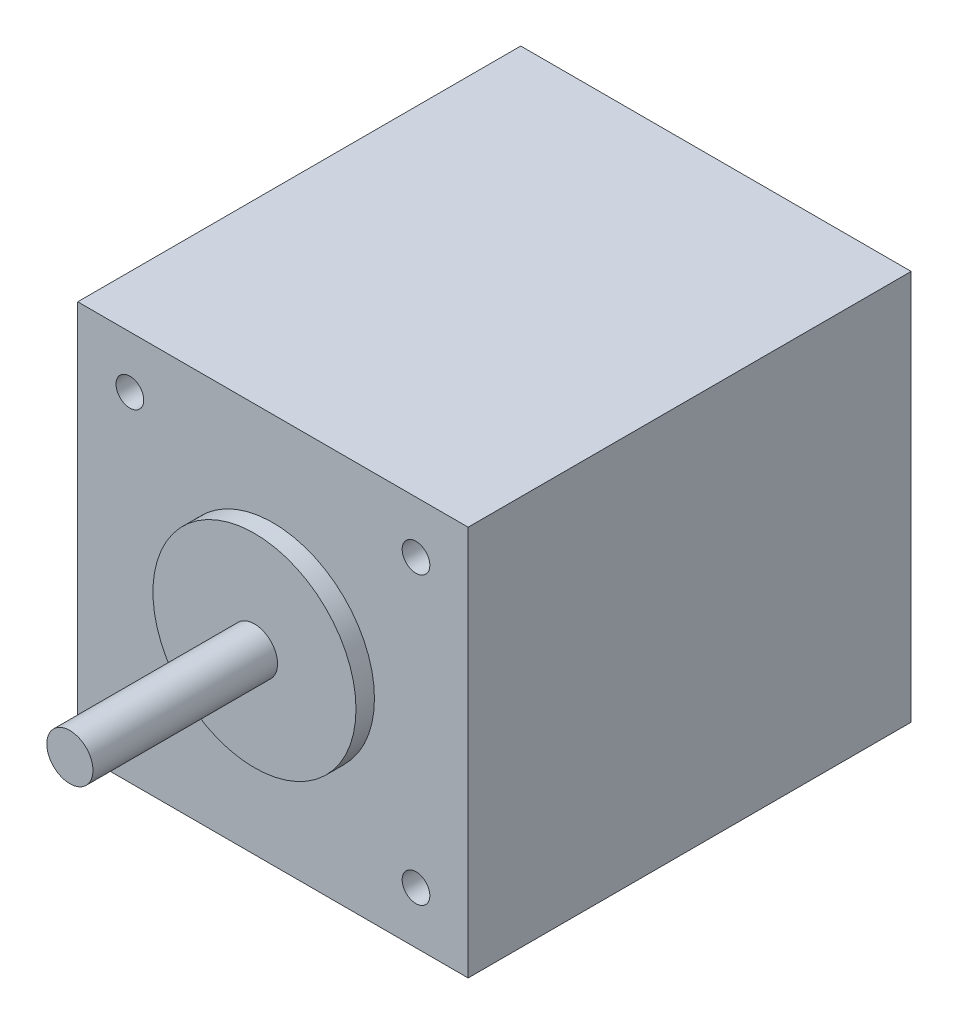
ISO-10303-21;
HEADER;
FILE_DESCRIPTION(('STEP AP214'),'2;1');
FILE_NAME('part.step','',(''),(''),'','','');
FILE_SCHEMA(('AUTOMOTIVE_DESIGN { 1 0 10303 214 1 1 1 1 }'));
ENDSEC;
DATA;
#1=APPLICATION_CONTEXT('core data for automotive mechanical design processes');
#2=APPLICATION_PROTOCOL_DEFINITION('international standard','automotive_design',2000,#1);
#3=PRODUCT_CONTEXT('',#1,'mechanical');
#4=PRODUCT('Part','Part','',(#3));
#5=PRODUCT_RELATED_PRODUCT_CATEGORY('part','',(#4));
#6=PRODUCT_DEFINITION_FORMATION('','',#4);
#7=PRODUCT_DEFINITION_CONTEXT('part definition',#1,'design');
#8=PRODUCT_DEFINITION('design','',#6,#7);
#9=PRODUCT_DEFINITION_SHAPE('','',#8);
#10=(LENGTH_UNIT() NAMED_UNIT(*) SI_UNIT(.MILLI.,.METRE.));
#11=(NAMED_UNIT(*) PLANE_ANGLE_UNIT() SI_UNIT($,.RADIAN.));
#12=(NAMED_UNIT(*) SI_UNIT($,.STERADIAN.) SOLID_ANGLE_UNIT());
#13=UNCERTAINTY_MEASURE_WITH_UNIT(LENGTH_MEASURE(1.E-05),#10,'distance_accuracy_value','');
#14=(GEOMETRIC_REPRESENTATION_CONTEXT(3) GLOBAL_UNCERTAINTY_ASSIGNED_CONTEXT((#13)) GLOBAL_UNIT_ASSIGNED_CONTEXT((#10,
#11,#12)) REPRESENTATION_CONTEXT('',''));
#15=CARTESIAN_POINT('',(0.,0.,0.));
#16=DIRECTION('',(0.,0.,1.));
#17=DIRECTION('',(1.,0.,0.));
#18=AXIS2_PLACEMENT_3D('',#15,#16,#17);
#19=CARTESIAN_POINT('',(-21.15,-21.15,0.));
#20=DIRECTION('',(0.,-1.,0.));
#21=DIRECTION('',(0.,0.,-1.));
#22=AXIS2_PLACEMENT_3D('',#19,#20,#21);
#23=PLANE('',#22);
#24=DIRECTION('',(0.,0.,-1.));
#25=VECTOR('',#24,1.);
#26=CARTESIAN_POINT('',(21.15,-21.15,0.));
#27=LINE('',#26,#25);
#28=CARTESIAN_POINT('',(21.15,-21.15,0.));
#29=VERTEX_POINT('',#28);
#30=CARTESIAN_POINT('',(21.15,-21.15,-48.));
#31=VERTEX_POINT('',#30);
#32=EDGE_CURVE('E99',#29,#31,#27,.T.);
#33=ORIENTED_EDGE('',*,*,#32,.F.);
#34=DIRECTION('',(1.,0.,0.));
#35=VECTOR('',#34,1.);
#36=CARTESIAN_POINT('',(-21.15,-21.15,0.));
#37=LINE('',#36,#35);
#38=CARTESIAN_POINT('',(-21.15,-21.15,0.));
#39=VERTEX_POINT('',#38);
#40=EDGE_CURVE('E42',#39,#29,#37,.T.);
#41=ORIENTED_EDGE('',*,*,#40,.F.);
#42=DIRECTION('',(0.,0.,-1.));
#43=VECTOR('',#42,1.);
#44=CARTESIAN_POINT('',(-21.15,-21.15,0.));
#45=LINE('',#44,#43);
#46=CARTESIAN_POINT('',(-21.15,-21.15,-48.));
#47=VERTEX_POINT('',#46);
#48=EDGE_CURVE('E93',#39,#47,#45,.T.);
#49=ORIENTED_EDGE('',*,*,#48,.T.);
#50=DIRECTION('',(1.,0.,0.));
#51=VECTOR('',#50,1.);
#52=CARTESIAN_POINT('',(-21.15,-21.15,-48.));
#53=LINE('',#52,#51);
#54=EDGE_CURVE('E36',#47,#31,#53,.T.);
#55=ORIENTED_EDGE('',*,*,#54,.T.);
#56=EDGE_LOOP('',(#33,#41,#49,#55));
#57=FACE_BOUND('',#56,.T.);
#58=ADVANCED_FACE('F33',(#57),#23,.T.);
#59=CARTESIAN_POINT('',(-21.15,21.15,0.));
#60=DIRECTION('',(0.,0.,1.));
#61=DIRECTION('',(1.,0.,0.));
#62=AXIS2_PLACEMENT_3D('',#59,#60,#61);
#63=PLANE('',#62);
#64=CARTESIAN_POINT('',(15.5,15.5,0.));
#65=DIRECTION('',(0.,0.,1.));
#66=DIRECTION('',(1.,0.,0.));
#67=AXIS2_PLACEMENT_3D('',#64,#65,#66);
#68=CIRCLE('',#67,1.49999999999999);
#69=CARTESIAN_POINT('',(17.,15.5,0.));
#70=VERTEX_POINT('',#69);
#71=EDGE_CURVE('E186',#70,#70,#68,.T.);
#72=ORIENTED_EDGE('',*,*,#71,.F.);
#73=EDGE_LOOP('',(#72));
#74=FACE_BOUND('',#73,.T.);
#75=CARTESIAN_POINT('',(15.5,-15.5,0.));
#76=DIRECTION('',(0.,0.,1.));
#77=DIRECTION('',(1.,0.,0.));
#78=AXIS2_PLACEMENT_3D('',#75,#76,#77);
#79=CIRCLE('',#78,1.49999999999999);
#80=CARTESIAN_POINT('',(17.,-15.5,0.));
#81=VERTEX_POINT('',#80);
#82=EDGE_CURVE('E188',#81,#81,#79,.T.);
#83=ORIENTED_EDGE('',*,*,#82,.F.);
#84=EDGE_LOOP('',(#83));
#85=FACE_BOUND('',#84,.T.);
#86=CARTESIAN_POINT('',(-15.5,15.5,0.));
#87=DIRECTION('',(0.,0.,1.));
#88=DIRECTION('',(1.,0.,0.));
#89=AXIS2_PLACEMENT_3D('',#86,#87,#88);
#90=CIRCLE('',#89,1.49999999999999);
#91=CARTESIAN_POINT('',(-14.,15.5,0.));
#92=VERTEX_POINT('',#91);
#93=EDGE_CURVE('E196',#92,#92,#90,.T.);
#94=ORIENTED_EDGE('',*,*,#93,.F.);
#95=EDGE_LOOP('',(#94));
#96=FACE_BOUND('',#95,.T.);
#97=CARTESIAN_POINT('',(-15.5,-15.5,0.));
#98=DIRECTION('',(0.,0.,1.));
#99=DIRECTION('',(1.,0.,0.));
#100=AXIS2_PLACEMENT_3D('',#97,#98,#99);
#101=CIRCLE('',#100,1.49999999999999);
#102=CARTESIAN_POINT('',(-14.,-15.5,0.));
#103=VERTEX_POINT('',#102);
#104=EDGE_CURVE('E202',#103,#103,#101,.T.);
#105=ORIENTED_EDGE('',*,*,#104,.F.);
#106=EDGE_LOOP('',(#105));
#107=FACE_BOUND('',#106,.T.);
#108=CARTESIAN_POINT('',(0.,0.,0.));
#109=DIRECTION('',(0.,0.,1.));
#110=DIRECTION('',(1.,0.,0.));
#111=AXIS2_PLACEMENT_3D('',#108,#109,#110);
#112=CIRCLE('',#111,11.);
#113=CARTESIAN_POINT('',(11.,0.,0.));
#114=VERTEX_POINT('',#113);
#115=EDGE_CURVE('E11',#114,#114,#112,.T.);
#116=ORIENTED_EDGE('',*,*,#115,.F.);
#117=EDGE_LOOP('',(#116));
#118=FACE_BOUND('',#117,.T.);
#119=DIRECTION('',(0.,-1.,0.));
#120=VECTOR('',#119,1.);
#121=CARTESIAN_POINT('',(21.15,21.15,0.));
#122=LINE('',#121,#120);
#123=CARTESIAN_POINT('',(21.15,21.15,0.));
#124=VERTEX_POINT('',#123);
#125=EDGE_CURVE('E95',#124,#29,#122,.T.);
#126=ORIENTED_EDGE('',*,*,#125,.F.);
#127=DIRECTION('',(1.,0.,0.));
#128=VECTOR('',#127,1.);
#129=CARTESIAN_POINT('',(-21.15,21.15,0.));
#130=LINE('',#129,#128);
#131=CARTESIAN_POINT('',(-21.15,21.15,0.));
#132=VERTEX_POINT('',#131);
#133=EDGE_CURVE('E67',#132,#124,#130,.T.);
#134=ORIENTED_EDGE('',*,*,#133,.F.);
#135=DIRECTION('',(0.,-1.,0.));
#136=VECTOR('',#135,1.);
#137=CARTESIAN_POINT('',(-21.15,21.15,0.));
#138=LINE('',#137,#136);
#139=EDGE_CURVE('E90',#132,#39,#138,.T.);
#140=ORIENTED_EDGE('',*,*,#139,.T.);
#141=ORIENTED_EDGE('',*,*,#40,.T.);
#142=EDGE_LOOP('',(#126,#134,#140,#141));
#143=FACE_BOUND('',#142,.T.);
#144=ADVANCED_FACE('F111',(#74,#85,#96,#107,#118,#143),#63,.T.);
#145=CARTESIAN_POINT('',(-21.15,21.15,-48.));
#146=DIRECTION('',(0.,1.,0.));
#147=DIRECTION('',(0.,0.,1.));
#148=AXIS2_PLACEMENT_3D('',#145,#146,#147);
#149=PLANE('',#148);
#150=DIRECTION('',(0.,0.,1.));
#151=VECTOR('',#150,1.);
#152=CARTESIAN_POINT('',(21.15,21.15,-48.));
#153=LINE('',#152,#151);
#154=CARTESIAN_POINT('',(21.15,21.15,-48.));
#155=VERTEX_POINT('',#154);
#156=EDGE_CURVE('E85',#155,#124,#153,.T.);
#157=ORIENTED_EDGE('',*,*,#156,.F.);
#158=DIRECTION('',(1.,0.,0.));
#159=VECTOR('',#158,1.);
#160=CARTESIAN_POINT('',(-21.15,21.15,-48.));
#161=LINE('',#160,#159);
#162=CARTESIAN_POINT('',(-21.15,21.15,-48.));
#163=VERTEX_POINT('',#162);
#164=EDGE_CURVE('E80',#163,#155,#161,.T.);
#165=ORIENTED_EDGE('',*,*,#164,.F.);
#166=DIRECTION('',(0.,0.,1.));
#167=VECTOR('',#166,1.);
#168=CARTESIAN_POINT('',(-21.15,21.15,-48.));
#169=LINE('',#168,#167);
#170=EDGE_CURVE('E83',#163,#132,#169,.T.);
#171=ORIENTED_EDGE('',*,*,#170,.T.);
#172=ORIENTED_EDGE('',*,*,#133,.T.);
#173=EDGE_LOOP('',(#157,#165,#171,#172));
#174=FACE_BOUND('',#173,.T.);
#175=ADVANCED_FACE('F82',(#174),#149,.T.);
#176=CARTESIAN_POINT('',(-21.15,-21.15,-48.));
#177=DIRECTION('',(0.,0.,-1.));
#178=DIRECTION('',(-1.,0.,0.));
#179=AXIS2_PLACEMENT_3D('',#176,#177,#178);
#180=PLANE('',#179);
#181=DIRECTION('',(0.,1.,0.));
#182=VECTOR('',#181,1.);
#183=CARTESIAN_POINT('',(21.15,-21.15,-48.));
#184=LINE('',#183,#182);
#185=EDGE_CURVE('E102',#31,#155,#184,.T.);
#186=ORIENTED_EDGE('',*,*,#185,.F.);
#187=ORIENTED_EDGE('',*,*,#54,.F.);
#188=DIRECTION('',(0.,1.,0.));
#189=VECTOR('',#188,1.);
#190=CARTESIAN_POINT('',(-21.15,-21.15,-48.));
#191=LINE('',#190,#189);
#192=EDGE_CURVE('E89',#47,#163,#191,.T.);
#193=ORIENTED_EDGE('',*,*,#192,.T.);
#194=ORIENTED_EDGE('',*,*,#164,.T.);
#195=EDGE_LOOP('',(#186,#187,#193,#194));
#196=FACE_BOUND('',#195,.T.);
#197=ADVANCED_FACE('F92',(#196),#180,.T.);
#198=CARTESIAN_POINT('',(-21.15,0.,0.));
#199=DIRECTION('',(1.,0.,0.));
#200=DIRECTION('',(0.,0.,-1.));
#201=AXIS2_PLACEMENT_3D('',#198,#199,#200);
#202=PLANE('',#201);
#203=ORIENTED_EDGE('',*,*,#48,.F.);
#204=ORIENTED_EDGE('',*,*,#139,.F.);
#205=ORIENTED_EDGE('',*,*,#170,.F.);
#206=ORIENTED_EDGE('',*,*,#192,.F.);
#207=EDGE_LOOP('',(#203,#204,#205,#206));
#208=FACE_BOUND('',#207,.T.);
#209=ADVANCED_FACE('F88',(#208),#202,.F.);
#210=CARTESIAN_POINT('',(21.15,0.,0.));
#211=DIRECTION('',(1.,0.,0.));
#212=DIRECTION('',(0.,0.,-1.));
#213=AXIS2_PLACEMENT_3D('',#210,#211,#212);
#214=PLANE('',#213);
#215=ORIENTED_EDGE('',*,*,#32,.T.);
#216=ORIENTED_EDGE('',*,*,#185,.T.);
#217=ORIENTED_EDGE('',*,*,#156,.T.);
#218=ORIENTED_EDGE('',*,*,#125,.T.);
#219=EDGE_LOOP('',(#215,#216,#217,#218));
#220=FACE_BOUND('',#219,.T.);
#221=ADVANCED_FACE('F110',(#220),#214,.T.);
#222=CARTESIAN_POINT('',(0.,0.,0.));
#223=DIRECTION('',(0.,0.,1.));
#224=DIRECTION('',(1.,0.,0.));
#225=AXIS2_PLACEMENT_3D('',#222,#223,#224);
#226=CYLINDRICAL_SURFACE('',#225,11.);
#227=ORIENTED_EDGE('',*,*,#115,.T.);
#228=EDGE_LOOP('',(#227));
#229=FACE_BOUND('',#228,.T.);
#230=CARTESIAN_POINT('',(0.,0.,2.));
#231=DIRECTION('',(0.,0.,1.));
#232=DIRECTION('',(1.,0.,0.));
#233=AXIS2_PLACEMENT_3D('',#230,#231,#232);
#234=CIRCLE('',#233,11.);
#235=CARTESIAN_POINT('',(11.,0.,2.));
#236=VERTEX_POINT('',#235);
#237=EDGE_CURVE('E208',#236,#236,#234,.T.);
#238=ORIENTED_EDGE('',*,*,#237,.F.);
#239=EDGE_LOOP('',(#238));
#240=FACE_BOUND('',#239,.T.);
#241=ADVANCED_FACE('F131',(#229,#240),#226,.T.);
#242=CARTESIAN_POINT('',(0.,0.,22.));
#243=DIRECTION('',(0.,0.,1.));
#244=DIRECTION('',(1.,0.,0.));
#245=AXIS2_PLACEMENT_3D('',#242,#243,#244);
#246=PLANE('',#245);
#247=CARTESIAN_POINT('',(0.,0.,22.));
#248=DIRECTION('',(0.,0.,1.));
#249=DIRECTION('',(1.,0.,0.));
#250=AXIS2_PLACEMENT_3D('',#247,#248,#249);
#251=CIRCLE('',#250,2.5);
#252=CARTESIAN_POINT('',(2.5,0.,22.));
#253=VERTEX_POINT('',#252);
#254=EDGE_CURVE('E103',#253,#253,#251,.T.);
#255=ORIENTED_EDGE('',*,*,#254,.T.);
#256=EDGE_LOOP('',(#255));
#257=FACE_BOUND('',#256,.T.);
#258=ADVANCED_FACE('F135',(#257),#246,.T.);
#259=CARTESIAN_POINT('',(0.,0.,0.));
#260=DIRECTION('',(0.,0.,1.));
#261=DIRECTION('',(1.,0.,0.));
#262=AXIS2_PLACEMENT_3D('',#259,#260,#261);
#263=CYLINDRICAL_SURFACE('',#262,2.5);
#264=CARTESIAN_POINT('',(0.,0.,2.));
#265=DIRECTION('',(0.,0.,1.));
#266=DIRECTION('',(1.,0.,0.));
#267=AXIS2_PLACEMENT_3D('',#264,#265,#266);
#268=CIRCLE('',#267,2.5);
#269=CARTESIAN_POINT('',(2.5,0.,2.));
#270=VERTEX_POINT('',#269);
#271=EDGE_CURVE('E211',#270,#270,#268,.T.);
#272=ORIENTED_EDGE('',*,*,#271,.T.);
#273=EDGE_LOOP('',(#272));
#274=FACE_BOUND('',#273,.T.);
#275=ORIENTED_EDGE('',*,*,#254,.F.);
#276=EDGE_LOOP('',(#275));
#277=FACE_BOUND('',#276,.T.);
#278=ADVANCED_FACE('F139',(#274,#277),#263,.T.);
#279=CARTESIAN_POINT('',(2.5,0.,2.));
#280=DIRECTION('',(0.,0.,1.));
#281=DIRECTION('',(1.,0.,0.));
#282=AXIS2_PLACEMENT_3D('',#279,#280,#281);
#283=PLANE('',#282);
#284=ORIENTED_EDGE('',*,*,#237,.T.);
#285=EDGE_LOOP('',(#284));
#286=FACE_BOUND('',#285,.T.);
#287=ORIENTED_EDGE('',*,*,#271,.F.);
#288=EDGE_LOOP('',(#287));
#289=FACE_BOUND('',#288,.T.);
#290=ADVANCED_FACE('F143',(#286,#289),#283,.T.);
#291=CARTESIAN_POINT('',(-15.5,-15.5,-5.));
#292=DIRECTION('',(0.,0.,-1.));
#293=DIRECTION('',(-1.,0.,0.));
#294=AXIS2_PLACEMENT_3D('',#291,#292,#293);
#295=PLANE('',#294);
#296=CARTESIAN_POINT('',(-15.5,-15.5,-5.));
#297=DIRECTION('',(0.,0.,1.));
#298=DIRECTION('',(1.,0.,0.));
#299=AXIS2_PLACEMENT_3D('',#296,#297,#298);
#300=CIRCLE('',#299,1.49999999999999);
#301=CARTESIAN_POINT('',(-14.,-15.5,-5.));
#302=VERTEX_POINT('',#301);
#303=EDGE_CURVE('E205',#302,#302,#300,.T.);
#304=ORIENTED_EDGE('',*,*,#303,.T.);
#305=EDGE_LOOP('',(#304));
#306=FACE_BOUND('',#305,.T.);
#307=ADVANCED_FACE('F147',(#306),#295,.F.);
#308=CARTESIAN_POINT('',(-15.5,-15.5,0.));
#309=DIRECTION('',(0.,0.,1.));
#310=DIRECTION('',(1.,0.,0.));
#311=AXIS2_PLACEMENT_3D('',#308,#309,#310);
#312=CYLINDRICAL_SURFACE('',#311,1.49999999999999);
#313=ORIENTED_EDGE('',*,*,#303,.F.);
#314=EDGE_LOOP('',(#313));
#315=FACE_BOUND('',#314,.T.);
#316=ORIENTED_EDGE('',*,*,#104,.T.);
#317=EDGE_LOOP('',(#316));
#318=FACE_BOUND('',#317,.T.);
#319=ADVANCED_FACE('F151',(#315,#318),#312,.F.);
#320=CARTESIAN_POINT('',(-15.5,15.5,-5.));
#321=DIRECTION('',(0.,0.,-1.));
#322=DIRECTION('',(-1.,0.,0.));
#323=AXIS2_PLACEMENT_3D('',#320,#321,#322);
#324=PLANE('',#323);
#325=CARTESIAN_POINT('',(-15.5,15.5,-5.));
#326=DIRECTION('',(0.,0.,1.));
#327=DIRECTION('',(1.,0.,0.));
#328=AXIS2_PLACEMENT_3D('',#325,#326,#327);
#329=CIRCLE('',#328,1.49999999999999);
#330=CARTESIAN_POINT('',(-14.,15.5,-5.));
#331=VERTEX_POINT('',#330);
#332=EDGE_CURVE('E199',#331,#331,#329,.T.);
#333=ORIENTED_EDGE('',*,*,#332,.T.);
#334=EDGE_LOOP('',(#333));
#335=FACE_BOUND('',#334,.T.);
#336=ADVANCED_FACE('F155',(#335),#324,.F.);
#337=CARTESIAN_POINT('',(-15.5,15.5,0.));
#338=DIRECTION('',(0.,0.,1.));
#339=DIRECTION('',(1.,0.,0.));
#340=AXIS2_PLACEMENT_3D('',#337,#338,#339);
#341=CYLINDRICAL_SURFACE('',#340,1.49999999999999);
#342=ORIENTED_EDGE('',*,*,#332,.F.);
#343=EDGE_LOOP('',(#342));
#344=FACE_BOUND('',#343,.T.);
#345=ORIENTED_EDGE('',*,*,#93,.T.);
#346=EDGE_LOOP('',(#345));
#347=FACE_BOUND('',#346,.T.);
#348=ADVANCED_FACE('F159',(#344,#347),#341,.F.);
#349=CARTESIAN_POINT('',(15.5,-15.5,-5.));
#350=DIRECTION('',(0.,0.,-1.));
#351=DIRECTION('',(-1.,0.,0.));
#352=AXIS2_PLACEMENT_3D('',#349,#350,#351);
#353=PLANE('',#352);
#354=CARTESIAN_POINT('',(15.5,-15.5,-5.));
#355=DIRECTION('',(0.,0.,1.));
#356=DIRECTION('',(1.,0.,0.));
#357=AXIS2_PLACEMENT_3D('',#354,#355,#356);
#358=CIRCLE('',#357,1.49999999999999);
#359=CARTESIAN_POINT('',(17.,-15.5,-5.));
#360=VERTEX_POINT('',#359);
#361=EDGE_CURVE('E193',#360,#360,#358,.T.);
#362=ORIENTED_EDGE('',*,*,#361,.T.);
#363=EDGE_LOOP('',(#362));
#364=FACE_BOUND('',#363,.T.);
#365=ADVANCED_FACE('F163',(#364),#353,.F.);
#366=CARTESIAN_POINT('',(15.5,-15.5,0.));
#367=DIRECTION('',(0.,0.,1.));
#368=DIRECTION('',(1.,0.,0.));
#369=AXIS2_PLACEMENT_3D('',#366,#367,#368);
#370=CYLINDRICAL_SURFACE('',#369,1.49999999999999);
#371=ORIENTED_EDGE('',*,*,#361,.F.);
#372=EDGE_LOOP('',(#371));
#373=FACE_BOUND('',#372,.T.);
#374=ORIENTED_EDGE('',*,*,#82,.T.);
#375=EDGE_LOOP('',(#374));
#376=FACE_BOUND('',#375,.T.);
#377=ADVANCED_FACE('F167',(#373,#376),#370,.F.);
#378=CARTESIAN_POINT('',(15.5,15.5,-5.));
#379=DIRECTION('',(0.,0.,-1.));
#380=DIRECTION('',(-1.,0.,0.));
#381=AXIS2_PLACEMENT_3D('',#378,#379,#380);
#382=PLANE('',#381);
#383=CARTESIAN_POINT('',(15.5,15.5,-5.));
#384=DIRECTION('',(0.,0.,1.));
#385=DIRECTION('',(1.,0.,0.));
#386=AXIS2_PLACEMENT_3D('',#383,#384,#385);
#387=CIRCLE('',#386,1.49999999999999);
#388=CARTESIAN_POINT('',(17.,15.5,-5.));
#389=VERTEX_POINT('',#388);
#390=EDGE_CURVE('E184',#389,#389,#387,.T.);
#391=ORIENTED_EDGE('',*,*,#390,.T.);
#392=EDGE_LOOP('',(#391));
#393=FACE_BOUND('',#392,.T.);
#394=ADVANCED_FACE('F171',(#393),#382,.F.);
#395=CARTESIAN_POINT('',(15.5,15.5,0.));
#396=DIRECTION('',(0.,0.,1.));
#397=DIRECTION('',(1.,0.,0.));
#398=AXIS2_PLACEMENT_3D('',#395,#396,#397);
#399=CYLINDRICAL_SURFACE('',#398,1.49999999999999);
#400=ORIENTED_EDGE('',*,*,#390,.F.);
#401=EDGE_LOOP('',(#400));
#402=FACE_BOUND('',#401,.T.);
#403=ORIENTED_EDGE('',*,*,#71,.T.);
#404=EDGE_LOOP('',(#403));
#405=FACE_BOUND('',#404,.T.);
#406=ADVANCED_FACE('F175',(#402,#405),#399,.F.);
#407=CLOSED_SHELL('',(#58,#144,#175,#197,#209,#221,#241,#258,#278,#290,#307,#319,#336,#348,#365,
#377,#394,#406));
#408=MANIFOLD_SOLID_BREP('B2',#407);
#409=ADVANCED_BREP_SHAPE_REPRESENTATION('',(#18,#408),#14);
#410=SHAPE_DEFINITION_REPRESENTATION(#9,#409);
ENDSEC;
END-ISO-10303-21;
